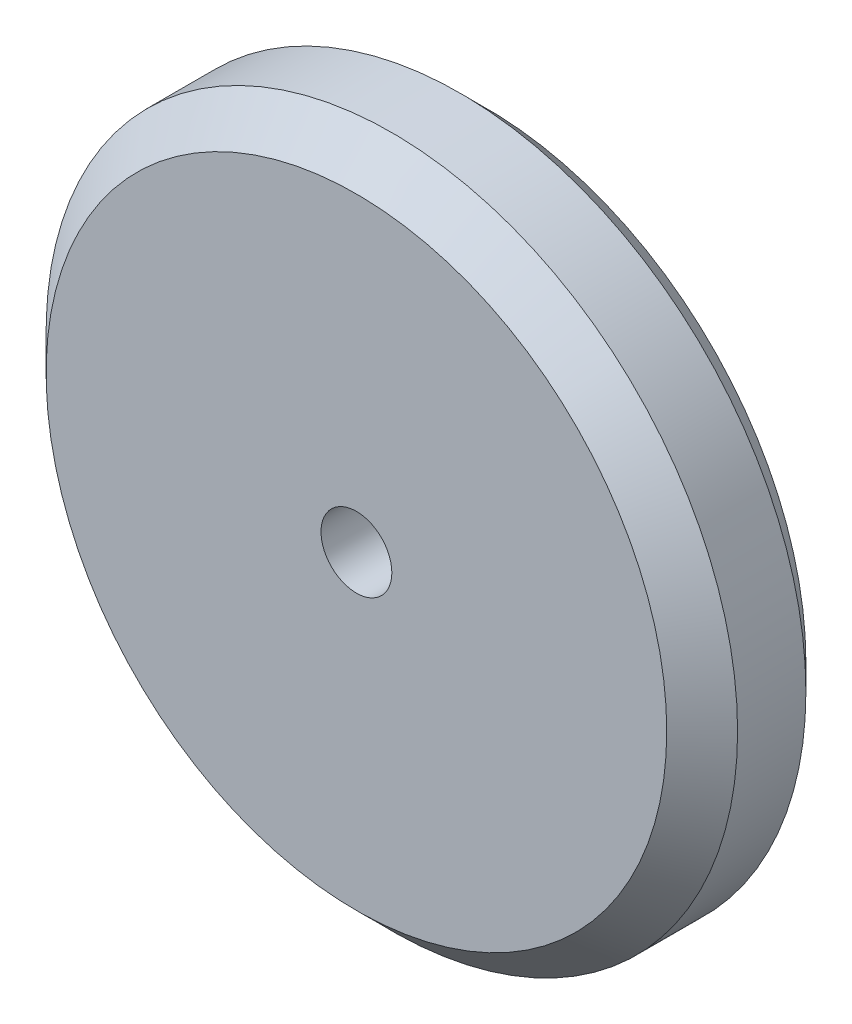
ISO-10303-21;
HEADER;
FILE_DESCRIPTION(('STEP AP214'),'2;1');
FILE_NAME('part.step','',(''),(''),'','','');
FILE_SCHEMA(('AUTOMOTIVE_DESIGN { 1 0 10303 214 1 1 1 1 }'));
ENDSEC;
DATA;
#1=APPLICATION_CONTEXT('core data for automotive mechanical design processes');
#2=APPLICATION_PROTOCOL_DEFINITION('international standard','automotive_design',2000,#1);
#3=PRODUCT_CONTEXT('',#1,'mechanical');
#4=PRODUCT('Part','Part','',(#3));
#5=PRODUCT_RELATED_PRODUCT_CATEGORY('part','',(#4));
#6=PRODUCT_DEFINITION_FORMATION('','',#4);
#7=PRODUCT_DEFINITION_CONTEXT('part definition',#1,'design');
#8=PRODUCT_DEFINITION('design','',#6,#7);
#9=PRODUCT_DEFINITION_SHAPE('','',#8);
#10=(LENGTH_UNIT() NAMED_UNIT(*) SI_UNIT(.MILLI.,.METRE.));
#11=(NAMED_UNIT(*) PLANE_ANGLE_UNIT() SI_UNIT($,.RADIAN.));
#12=(NAMED_UNIT(*) SI_UNIT($,.STERADIAN.) SOLID_ANGLE_UNIT());
#13=UNCERTAINTY_MEASURE_WITH_UNIT(LENGTH_MEASURE(1.E-05),#10,'distance_accuracy_value','');
#14=(GEOMETRIC_REPRESENTATION_CONTEXT(3) GLOBAL_UNCERTAINTY_ASSIGNED_CONTEXT((#13)) GLOBAL_UNIT_ASSIGNED_CONTEXT((#10,
#11,#12)) REPRESENTATION_CONTEXT('',''));
#15=CARTESIAN_POINT('',(0.,0.,0.));
#16=DIRECTION('',(0.,0.,1.));
#17=DIRECTION('',(1.,0.,0.));
#18=AXIS2_PLACEMENT_3D('',#15,#16,#17);
#19=CARTESIAN_POINT('',(0.,0.,16.1479796424603));
#20=DIRECTION('',(0.,0.,1.));
#21=DIRECTION('',(1.,0.,0.));
#22=AXIS2_PLACEMENT_3D('',#19,#20,#21);
#23=CONICAL_SURFACE('',#22,0.975999999990777,0.785398163397448);
#24=CARTESIAN_POINT('',(0.,0.,16.1479796424433));
#25=DIRECTION('',(0.,0.,1.));
#26=DIRECTION('',(1.,0.,0.));
#27=AXIS2_PLACEMENT_3D('',#24,#25,#26);
#28=CIRCLE('',#27,0.976);
#29=CARTESIAN_POINT('',(0.976000000000057,0.,16.1479796424433));
#30=VERTEX_POINT('',#29);
#31=EDGE_CURVE('E46',#30,#30,#28,.T.);
#32=ORIENTED_EDGE('',*,*,#31,.F.);
#33=EDGE_LOOP('',(#32));
#34=FACE_BOUND('',#33,.T.);
#35=CARTESIAN_POINT('',(0.,0.,16.0747796424648));
#36=DIRECTION('',(0.,0.,1.));
#37=DIRECTION('',(1.,0.,0.));
#38=AXIS2_PLACEMENT_3D('',#35,#36,#37);
#39=CIRCLE('',#38,0.902799999995282);
#40=CARTESIAN_POINT('',(0.902799999995339,0.,16.0747796424648));
#41=VERTEX_POINT('',#40);
#42=EDGE_CURVE('E50',#41,#41,#39,.T.);
#43=ORIENTED_EDGE('',*,*,#42,.T.);
#44=EDGE_LOOP('',(#43));
#45=FACE_BOUND('',#44,.T.);
#46=ADVANCED_FACE('F35',(#34,#45),#23,.T.);
#47=CARTESIAN_POINT('',(0.,0.,16.0747796424433));
#48=DIRECTION('',(0.,0.,1.));
#49=DIRECTION('',(1.,0.,0.));
#50=AXIS2_PLACEMENT_3D('',#47,#48,#49);
#51=PLANE('',#50);
#52=ORIENTED_EDGE('',*,*,#42,.F.);
#53=EDGE_LOOP('',(#52));
#54=FACE_BOUND('',#53,.T.);
#55=CARTESIAN_POINT('',(0.,0.,16.0747796424433));
#56=DIRECTION('',(0.,0.,1.));
#57=DIRECTION('',(1.,0.,0.));
#58=AXIS2_PLACEMENT_3D('',#55,#56,#57);
#59=CIRCLE('',#58,0.1);
#60=CARTESIAN_POINT('',(0.100000000000057,0.,16.0747796424433));
#61=VERTEX_POINT('',#60);
#62=EDGE_CURVE('E55',#61,#61,#59,.F.);
#63=ORIENTED_EDGE('',*,*,#62,.F.);
#64=EDGE_LOOP('',(#63));
#65=FACE_BOUND('',#64,.T.);
#66=ADVANCED_FACE('F77',(#54,#65),#51,.F.);
#67=CARTESIAN_POINT('',(0.,0.,16.0747796424433));
#68=DIRECTION('',(0.,0.,1.));
#69=DIRECTION('',(1.,0.,0.));
#70=AXIS2_PLACEMENT_3D('',#67,#68,#69);
#71=CYLINDRICAL_SURFACE('',#70,0.976);
#72=CARTESIAN_POINT('',(0.,0.,16.3407796424433));
#73=DIRECTION('',(0.,0.,1.));
#74=DIRECTION('',(1.,0.,0.));
#75=AXIS2_PLACEMENT_3D('',#72,#73,#74);
#76=CIRCLE('',#75,0.976);
#77=CARTESIAN_POINT('',(0.976000000000057,0.,16.3407796424433));
#78=VERTEX_POINT('',#77);
#79=EDGE_CURVE('E10',#78,#78,#76,.F.);
#80=ORIENTED_EDGE('',*,*,#79,.T.);
#81=EDGE_LOOP('',(#80));
#82=FACE_BOUND('',#81,.T.);
#83=ORIENTED_EDGE('',*,*,#31,.T.);
#84=EDGE_LOOP('',(#83));
#85=FACE_BOUND('',#84,.T.);
#86=ADVANCED_FACE('F68',(#82,#85),#71,.T.);
#87=CARTESIAN_POINT('',(0.,0.,16.4407796424433));
#88=DIRECTION('',(0.,0.,1.));
#89=DIRECTION('',(1.,0.,0.));
#90=AXIS2_PLACEMENT_3D('',#87,#88,#89);
#91=PLANE('',#90);
#92=CARTESIAN_POINT('',(0.,0.,16.4407796424433));
#93=DIRECTION('',(0.,0.,1.));
#94=DIRECTION('',(1.,0.,0.));
#95=AXIS2_PLACEMENT_3D('',#92,#93,#94);
#96=CIRCLE('',#95,0.876000000000001);
#97=CARTESIAN_POINT('',(0.876000000000058,0.,16.4407796424433));
#98=VERTEX_POINT('',#97);
#99=EDGE_CURVE('E42',#98,#98,#96,.T.);
#100=ORIENTED_EDGE('',*,*,#99,.T.);
#101=EDGE_LOOP('',(#100));
#102=FACE_BOUND('',#101,.T.);
#103=CARTESIAN_POINT('',(0.,0.,16.4407796424433));
#104=DIRECTION('',(0.,0.,1.));
#105=DIRECTION('',(1.,0.,0.));
#106=AXIS2_PLACEMENT_3D('',#103,#104,#105);
#107=CIRCLE('',#106,0.1);
#108=CARTESIAN_POINT('',(0.100000000000057,0.,16.4407796424433));
#109=VERTEX_POINT('',#108);
#110=EDGE_CURVE('E60',#109,#109,#107,.T.);
#111=ORIENTED_EDGE('',*,*,#110,.F.);
#112=EDGE_LOOP('',(#111));
#113=FACE_BOUND('',#112,.T.);
#114=ADVANCED_FACE('F66',(#102,#113),#91,.T.);
#115=CARTESIAN_POINT('',(0.,0.,16.4407796424433));
#116=DIRECTION('',(0.,0.,-1.));
#117=DIRECTION('',(-1.,0.,0.));
#118=AXIS2_PLACEMENT_3D('',#115,#116,#117);
#119=CONICAL_SURFACE('',#118,0.876000000000001,0.785398163397445);
#120=ORIENTED_EDGE('',*,*,#79,.F.);
#121=EDGE_LOOP('',(#120));
#122=FACE_BOUND('',#121,.T.);
#123=ORIENTED_EDGE('',*,*,#99,.F.);
#124=EDGE_LOOP('',(#123));
#125=FACE_BOUND('',#124,.T.);
#126=ADVANCED_FACE('F37',(#122,#125),#119,.T.);
#127=CARTESIAN_POINT('',(0.,0.,15.3846434240052));
#128=DIRECTION('',(0.,0.,1.));
#129=DIRECTION('',(1.,0.,0.));
#130=AXIS2_PLACEMENT_3D('',#127,#128,#129);
#131=CYLINDRICAL_SURFACE('',#130,0.1);
#132=ORIENTED_EDGE('',*,*,#62,.T.);
#133=EDGE_LOOP('',(#132));
#134=FACE_BOUND('',#133,.T.);
#135=ORIENTED_EDGE('',*,*,#110,.T.);
#136=EDGE_LOOP('',(#135));
#137=FACE_BOUND('',#136,.T.);
#138=ADVANCED_FACE('F64',(#134,#137),#131,.F.);
#139=CLOSED_SHELL('',(#46,#66,#86,#114,#126,#138));
#140=MANIFOLD_SOLID_BREP('B2',#139);
#141=ADVANCED_BREP_SHAPE_REPRESENTATION('',(#18,#140),#14);
#142=SHAPE_DEFINITION_REPRESENTATION(#9,#141);
ENDSEC;
END-ISO-10303-21;
